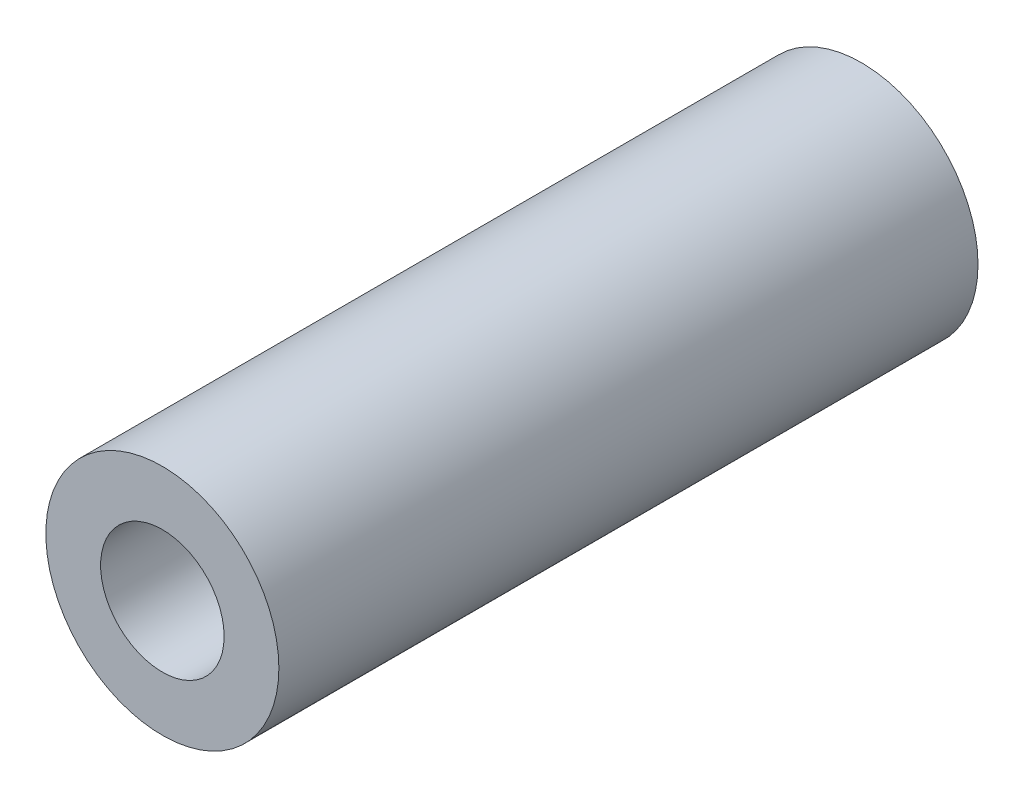
ISO-10303-21;
HEADER;
FILE_DESCRIPTION(('STEP AP214'),'2;1');
FILE_NAME('part.step','',(''),(''),'','','');
FILE_SCHEMA(('AUTOMOTIVE_DESIGN { 1 0 10303 214 1 1 1 1 }'));
ENDSEC;
DATA;
#1=APPLICATION_CONTEXT('core data for automotive mechanical design processes');
#2=APPLICATION_PROTOCOL_DEFINITION('international standard','automotive_design',2000,#1);
#3=PRODUCT_CONTEXT('',#1,'mechanical');
#4=PRODUCT('Part','Part','',(#3));
#5=PRODUCT_RELATED_PRODUCT_CATEGORY('part','',(#4));
#6=PRODUCT_DEFINITION_FORMATION('','',#4);
#7=PRODUCT_DEFINITION_CONTEXT('part definition',#1,'design');
#8=PRODUCT_DEFINITION('design','',#6,#7);
#9=PRODUCT_DEFINITION_SHAPE('','',#8);
#10=(LENGTH_UNIT() NAMED_UNIT(*) SI_UNIT(.MILLI.,.METRE.));
#11=(NAMED_UNIT(*) PLANE_ANGLE_UNIT() SI_UNIT($,.RADIAN.));
#12=(NAMED_UNIT(*) SI_UNIT($,.STERADIAN.) SOLID_ANGLE_UNIT());
#13=UNCERTAINTY_MEASURE_WITH_UNIT(LENGTH_MEASURE(1.E-05),#10,'distance_accuracy_value','');
#14=(GEOMETRIC_REPRESENTATION_CONTEXT(3) GLOBAL_UNCERTAINTY_ASSIGNED_CONTEXT((#13)) GLOBAL_UNIT_ASSIGNED_CONTEXT((#10,
#11,#12)) REPRESENTATION_CONTEXT('',''));
#15=CARTESIAN_POINT('',(0.,0.,0.));
#16=DIRECTION('',(0.,0.,1.));
#17=DIRECTION('',(1.,0.,0.));
#18=AXIS2_PLACEMENT_3D('',#15,#16,#17);
#19=CARTESIAN_POINT('',(0.,0.,15.));
#20=DIRECTION('',(0.,0.,1.));
#21=DIRECTION('',(1.,0.,0.));
#22=AXIS2_PLACEMENT_3D('',#19,#20,#21);
#23=PLANE('',#22);
#24=CARTESIAN_POINT('',(0.,0.,15.));
#25=DIRECTION('',(0.,0.,1.));
#26=DIRECTION('',(1.,0.,0.));
#27=AXIS2_PLACEMENT_3D('',#24,#25,#26);
#28=CIRCLE('',#27,5.);
#29=CARTESIAN_POINT('',(5.,0.,15.));
#30=VERTEX_POINT('',#29);
#31=EDGE_CURVE('E10',#30,#30,#28,.T.);
#32=ORIENTED_EDGE('',*,*,#31,.T.);
#33=EDGE_LOOP('',(#32));
#34=FACE_BOUND('',#33,.T.);
#35=CARTESIAN_POINT('',(0.,0.,15.));
#36=DIRECTION('',(0.,0.,1.));
#37=DIRECTION('',(1.,0.,0.));
#38=AXIS2_PLACEMENT_3D('',#35,#36,#37);
#39=CIRCLE('',#38,2.65);
#40=CARTESIAN_POINT('',(2.65,0.,15.));
#41=VERTEX_POINT('',#40);
#42=EDGE_CURVE('E41',#41,#41,#39,.T.);
#43=ORIENTED_EDGE('',*,*,#42,.F.);
#44=EDGE_LOOP('',(#43));
#45=FACE_BOUND('',#44,.T.);
#46=ADVANCED_FACE('F30',(#34,#45),#23,.T.);
#47=CARTESIAN_POINT('',(0.,0.,-15.));
#48=DIRECTION('',(0.,0.,1.));
#49=DIRECTION('',(1.,0.,0.));
#50=AXIS2_PLACEMENT_3D('',#47,#48,#49);
#51=PLANE('',#50);
#52=CARTESIAN_POINT('',(0.,0.,-15.));
#53=DIRECTION('',(0.,0.,1.));
#54=DIRECTION('',(1.,0.,0.));
#55=AXIS2_PLACEMENT_3D('',#52,#53,#54);
#56=CIRCLE('',#55,5.);
#57=CARTESIAN_POINT('',(5.,0.,-15.));
#58=VERTEX_POINT('',#57);
#59=EDGE_CURVE('E34',#58,#58,#56,.T.);
#60=ORIENTED_EDGE('',*,*,#59,.F.);
#61=EDGE_LOOP('',(#60));
#62=FACE_BOUND('',#61,.T.);
#63=CARTESIAN_POINT('',(0.,0.,-15.));
#64=DIRECTION('',(0.,0.,1.));
#65=DIRECTION('',(1.,0.,0.));
#66=AXIS2_PLACEMENT_3D('',#63,#64,#65);
#67=CIRCLE('',#66,2.65);
#68=CARTESIAN_POINT('',(2.65,0.,-15.));
#69=VERTEX_POINT('',#68);
#70=EDGE_CURVE('E43',#69,#69,#67,.T.);
#71=ORIENTED_EDGE('',*,*,#70,.T.);
#72=EDGE_LOOP('',(#71));
#73=FACE_BOUND('',#72,.T.);
#74=ADVANCED_FACE('F53',(#62,#73),#51,.F.);
#75=CARTESIAN_POINT('',(0.,0.,15.));
#76=DIRECTION('',(0.,0.,-1.));
#77=DIRECTION('',(-1.,0.,0.));
#78=AXIS2_PLACEMENT_3D('',#75,#76,#77);
#79=CYLINDRICAL_SURFACE('',#78,5.);
#80=ORIENTED_EDGE('',*,*,#31,.F.);
#81=EDGE_LOOP('',(#80));
#82=FACE_BOUND('',#81,.T.);
#83=ORIENTED_EDGE('',*,*,#59,.T.);
#84=EDGE_LOOP('',(#83));
#85=FACE_BOUND('',#84,.T.);
#86=ADVANCED_FACE('F32',(#82,#85),#79,.T.);
#87=CARTESIAN_POINT('',(0.,0.,15.));
#88=DIRECTION('',(0.,0.,-1.));
#89=DIRECTION('',(-1.,0.,0.));
#90=AXIS2_PLACEMENT_3D('',#87,#88,#89);
#91=CYLINDRICAL_SURFACE('',#90,2.65);
#92=ORIENTED_EDGE('',*,*,#42,.T.);
#93=EDGE_LOOP('',(#92));
#94=FACE_BOUND('',#93,.T.);
#95=ORIENTED_EDGE('',*,*,#70,.F.);
#96=EDGE_LOOP('',(#95));
#97=FACE_BOUND('',#96,.T.);
#98=ADVANCED_FACE('F49',(#94,#97),#91,.F.);
#99=CLOSED_SHELL('',(#46,#74,#86,#98));
#100=MANIFOLD_SOLID_BREP('B2',#99);
#101=ADVANCED_BREP_SHAPE_REPRESENTATION('',(#18,#100),#14);
#102=SHAPE_DEFINITION_REPRESENTATION(#9,#101);
ENDSEC;
END-ISO-10303-21;
